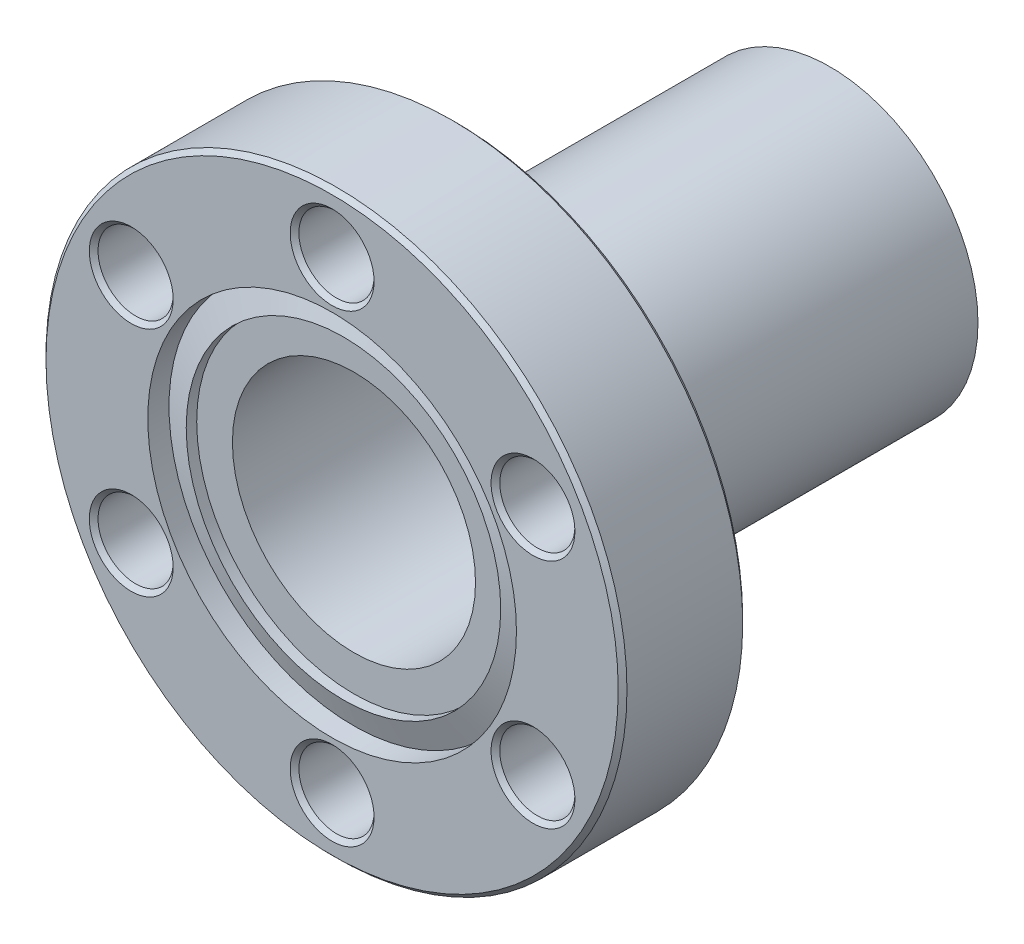
ISO-10303-21;
HEADER;
FILE_DESCRIPTION(('STEP AP214'),'2;1');
FILE_NAME('part.step','',(''),(''),'','','');
FILE_SCHEMA(('AUTOMOTIVE_DESIGN { 1 0 10303 214 1 1 1 1 }'));
ENDSEC;
DATA;
#1=APPLICATION_CONTEXT('core data for automotive mechanical design processes');
#2=APPLICATION_PROTOCOL_DEFINITION('international standard','automotive_design',2000,#1);
#3=PRODUCT_CONTEXT('',#1,'mechanical');
#4=PRODUCT('Part','Part','',(#3));
#5=PRODUCT_RELATED_PRODUCT_CATEGORY('part','',(#4));
#6=PRODUCT_DEFINITION_FORMATION('','',#4);
#7=PRODUCT_DEFINITION_CONTEXT('part definition',#1,'design');
#8=PRODUCT_DEFINITION('design','',#6,#7);
#9=PRODUCT_DEFINITION_SHAPE('','',#8);
#10=(LENGTH_UNIT() NAMED_UNIT(*) SI_UNIT(.MILLI.,.METRE.));
#11=(NAMED_UNIT(*) PLANE_ANGLE_UNIT() SI_UNIT($,.RADIAN.));
#12=(NAMED_UNIT(*) SI_UNIT($,.STERADIAN.) SOLID_ANGLE_UNIT());
#13=UNCERTAINTY_MEASURE_WITH_UNIT(LENGTH_MEASURE(1.E-05),#10,'distance_accuracy_value','');
#14=(GEOMETRIC_REPRESENTATION_CONTEXT(3) GLOBAL_UNCERTAINTY_ASSIGNED_CONTEXT((#13)) GLOBAL_UNIT_ASSIGNED_CONTEXT((#10,
#11,#12)) REPRESENTATION_CONTEXT('',''));
#15=CARTESIAN_POINT('',(0.,0.,0.));
#16=DIRECTION('',(0.,0.,1.));
#17=DIRECTION('',(1.,0.,0.));
#18=AXIS2_PLACEMENT_3D('',#15,#16,#17);
#19=CARTESIAN_POINT('',(16.8909999999993,0.,-7.239));
#20=DIRECTION('',(0.,0.,-1.));
#21=DIRECTION('',(-1.,0.,0.));
#22=AXIS2_PLACEMENT_3D('',#19,#20,#21);
#23=PLANE('',#22);
#24=CARTESIAN_POINT('',(-11.6804310310013,-6.7437,-7.239));
#25=DIRECTION('',(0.,0.,-1.));
#26=DIRECTION('',(-1.,0.,0.));
#27=AXIS2_PLACEMENT_3D('',#24,#25,#26);
#28=CIRCLE('',#27,2.43840000007532);
#29=CARTESIAN_POINT('',(-14.1188310310766,-6.7437,-7.239));
#30=VERTEX_POINT('',#29);
#31=EDGE_CURVE('E113',#30,#30,#28,.F.);
#32=ORIENTED_EDGE('',*,*,#31,.T.);
#33=EDGE_LOOP('',(#32));
#34=FACE_BOUND('',#33,.T.);
#35=CARTESIAN_POINT('',(11.6804310310013,-6.7437,-7.239));
#36=DIRECTION('',(0.,0.,-1.));
#37=DIRECTION('',(-1.,0.,0.));
#38=AXIS2_PLACEMENT_3D('',#35,#36,#37);
#39=CIRCLE('',#38,2.43840000007531);
#40=CARTESIAN_POINT('',(9.24203103092599,-6.7437,-7.239));
#41=VERTEX_POINT('',#40);
#42=EDGE_CURVE('E110',#41,#41,#39,.F.);
#43=ORIENTED_EDGE('',*,*,#42,.T.);
#44=EDGE_LOOP('',(#43));
#45=FACE_BOUND('',#44,.T.);
#46=CARTESIAN_POINT('',(0.,13.4874,-7.239));
#47=DIRECTION('',(0.,0.,-1.));
#48=DIRECTION('',(-1.,0.,0.));
#49=AXIS2_PLACEMENT_3D('',#46,#47,#48);
#50=CIRCLE('',#49,2.43840000007531);
#51=CARTESIAN_POINT('',(-2.43840000007531,13.4874,-7.239));
#52=VERTEX_POINT('',#51);
#53=EDGE_CURVE('E107',#52,#52,#50,.F.);
#54=ORIENTED_EDGE('',*,*,#53,.T.);
#55=EDGE_LOOP('',(#54));
#56=FACE_BOUND('',#55,.T.);
#57=CARTESIAN_POINT('',(-11.6804310310013,6.7437,-7.239));
#58=DIRECTION('',(0.,0.,-1.));
#59=DIRECTION('',(-1.,0.,0.));
#60=AXIS2_PLACEMENT_3D('',#57,#58,#59);
#61=CIRCLE('',#60,2.43840000007532);
#62=CARTESIAN_POINT('',(-14.1188310310766,6.7437,-7.239));
#63=VERTEX_POINT('',#62);
#64=EDGE_CURVE('E104',#63,#63,#61,.F.);
#65=ORIENTED_EDGE('',*,*,#64,.T.);
#66=EDGE_LOOP('',(#65));
#67=FACE_BOUND('',#66,.T.);
#68=CARTESIAN_POINT('',(11.6804310310013,6.7437,-7.239));
#69=DIRECTION('',(0.,0.,-1.));
#70=DIRECTION('',(-1.,0.,0.));
#71=AXIS2_PLACEMENT_3D('',#68,#69,#70);
#72=CIRCLE('',#71,2.43840000007532);
#73=CARTESIAN_POINT('',(9.24203103092598,6.7437,-7.239));
#74=VERTEX_POINT('',#73);
#75=EDGE_CURVE('E101',#74,#74,#72,.F.);
#76=ORIENTED_EDGE('',*,*,#75,.T.);
#77=EDGE_LOOP('',(#76));
#78=FACE_BOUND('',#77,.T.);
#79=CARTESIAN_POINT('',(0.,-13.4874,-7.239));
#80=DIRECTION('',(0.,0.,-1.));
#81=DIRECTION('',(-1.,0.,0.));
#82=AXIS2_PLACEMENT_3D('',#79,#80,#81);
#83=CIRCLE('',#82,2.43840000007531);
#84=CARTESIAN_POINT('',(-2.43840000007531,-13.4874,-7.239));
#85=VERTEX_POINT('',#84);
#86=EDGE_CURVE('E98',#85,#85,#83,.F.);
#87=ORIENTED_EDGE('',*,*,#86,.T.);
#88=EDGE_LOOP('',(#87));
#89=FACE_BOUND('',#88,.T.);
#90=CARTESIAN_POINT('',(0.,0.,-7.239));
#91=DIRECTION('',(0.,0.,-1.));
#92=DIRECTION('',(-1.,0.,0.));
#93=AXIS2_PLACEMENT_3D('',#90,#91,#92);
#94=CIRCLE('',#93,16.6369999999239);
#95=CARTESIAN_POINT('',(-16.6369999999239,0.,-7.239));
#96=VERTEX_POINT('',#95);
#97=EDGE_CURVE('E95',#96,#96,#94,.T.);
#98=ORIENTED_EDGE('',*,*,#97,.T.);
#99=EDGE_LOOP('',(#98));
#100=FACE_BOUND('',#99,.T.);
#101=CARTESIAN_POINT('',(0.,0.,-7.239));
#102=DIRECTION('',(0.,0.,-1.));
#103=DIRECTION('',(-1.,0.,0.));
#104=AXIS2_PLACEMENT_3D('',#101,#102,#103);
#105=CIRCLE('',#104,8.60055437225703);
#106=CARTESIAN_POINT('',(-8.60055437225703,0.,-7.239));
#107=VERTEX_POINT('',#106);
#108=EDGE_CURVE('E135',#107,#107,#105,.T.);
#109=ORIENTED_EDGE('',*,*,#108,.F.);
#110=EDGE_LOOP('',(#109));
#111=FACE_BOUND('',#110,.T.);
#112=ADVANCED_FACE('F30',(#34,#45,#56,#67,#78,#89,#100,#111),#23,.T.);
#113=CARTESIAN_POINT('',(0.,0.,-7.239));
#114=DIRECTION('',(0.,0.,1.));
#115=DIRECTION('',(1.,0.,0.));
#116=AXIS2_PLACEMENT_3D('',#113,#114,#115);
#117=CYLINDRICAL_SURFACE('',#116,16.8909999999993);
#118=CARTESIAN_POINT('',(0.,0.,-6.98499999992468));
#119=DIRECTION('',(0.,0.,-1.));
#120=DIRECTION('',(-1.,0.,0.));
#121=AXIS2_PLACEMENT_3D('',#118,#119,#120);
#122=CIRCLE('',#121,16.8909999999993);
#123=CARTESIAN_POINT('',(-16.8909999999993,0.,-6.98499999992468));
#124=VERTEX_POINT('',#123);
#125=EDGE_CURVE('E116',#124,#124,#122,.F.);
#126=ORIENTED_EDGE('',*,*,#125,.T.);
#127=EDGE_LOOP('',(#126));
#128=FACE_BOUND('',#127,.T.);
#129=CARTESIAN_POINT('',(0.,0.,-0.254000000075326));
#130=DIRECTION('',(0.,0.,1.));
#131=DIRECTION('',(1.,0.,0.));
#132=AXIS2_PLACEMENT_3D('',#129,#130,#131);
#133=CIRCLE('',#132,16.8909999999993);
#134=CARTESIAN_POINT('',(16.8909999999993,0.,-0.254000000075326));
#135=VERTEX_POINT('',#134);
#136=EDGE_CURVE('E119',#135,#135,#133,.F.);
#137=ORIENTED_EDGE('',*,*,#136,.T.);
#138=EDGE_LOOP('',(#137));
#139=FACE_BOUND('',#138,.T.);
#140=ADVANCED_FACE('F162',(#128,#139),#117,.T.);
#141=CARTESIAN_POINT('',(10.7187999999993,0.,0.));
#142=DIRECTION('',(0.,0.,1.));
#143=DIRECTION('',(1.,0.,0.));
#144=AXIS2_PLACEMENT_3D('',#141,#142,#143);
#145=PLANE('',#144);
#146=CARTESIAN_POINT('',(0.,13.4874,0.));
#147=DIRECTION('',(0.,0.,1.));
#148=DIRECTION('',(1.,0.,0.));
#149=AXIS2_PLACEMENT_3D('',#146,#147,#148);
#150=CIRCLE('',#149,2.43840000007531);
#151=CARTESIAN_POINT('',(2.43840000007531,13.4874,0.));
#152=VERTEX_POINT('',#151);
#153=EDGE_CURVE('E62',#152,#152,#150,.F.);
#154=ORIENTED_EDGE('',*,*,#153,.T.);
#155=EDGE_LOOP('',(#154));
#156=FACE_BOUND('',#155,.T.);
#157=CARTESIAN_POINT('',(11.6804310310013,6.7437,0.));
#158=DIRECTION('',(0.,0.,1.));
#159=DIRECTION('',(1.,0.,0.));
#160=AXIS2_PLACEMENT_3D('',#157,#158,#159);
#161=CIRCLE('',#160,2.43840000007531);
#162=CARTESIAN_POINT('',(14.1188310310766,6.7437,0.));
#163=VERTEX_POINT('',#162);
#164=EDGE_CURVE('E65',#163,#163,#161,.F.);
#165=ORIENTED_EDGE('',*,*,#164,.T.);
#166=EDGE_LOOP('',(#165));
#167=FACE_BOUND('',#166,.T.);
#168=CARTESIAN_POINT('',(11.6804310310013,-6.7437,0.));
#169=DIRECTION('',(0.,0.,1.));
#170=DIRECTION('',(1.,0.,0.));
#171=AXIS2_PLACEMENT_3D('',#168,#169,#170);
#172=CIRCLE('',#171,2.43840000007532);
#173=CARTESIAN_POINT('',(14.1188310310766,-6.7437,0.));
#174=VERTEX_POINT('',#173);
#175=EDGE_CURVE('E68',#174,#174,#172,.F.);
#176=ORIENTED_EDGE('',*,*,#175,.T.);
#177=EDGE_LOOP('',(#176));
#178=FACE_BOUND('',#177,.T.);
#179=CARTESIAN_POINT('',(0.,-13.4874,0.));
#180=DIRECTION('',(0.,0.,1.));
#181=DIRECTION('',(1.,0.,0.));
#182=AXIS2_PLACEMENT_3D('',#179,#180,#181);
#183=CIRCLE('',#182,2.43840000007531);
#184=CARTESIAN_POINT('',(2.43840000007531,-13.4874,0.));
#185=VERTEX_POINT('',#184);
#186=EDGE_CURVE('E71',#185,#185,#183,.F.);
#187=ORIENTED_EDGE('',*,*,#186,.T.);
#188=EDGE_LOOP('',(#187));
#189=FACE_BOUND('',#188,.T.);
#190=CARTESIAN_POINT('',(-11.6804310310013,-6.7437,0.));
#191=DIRECTION('',(0.,0.,1.));
#192=DIRECTION('',(1.,0.,0.));
#193=AXIS2_PLACEMENT_3D('',#190,#191,#192);
#194=CIRCLE('',#193,2.43840000007531);
#195=CARTESIAN_POINT('',(-9.24203103092599,-6.7437,0.));
#196=VERTEX_POINT('',#195);
#197=EDGE_CURVE('E74',#196,#196,#194,.F.);
#198=ORIENTED_EDGE('',*,*,#197,.T.);
#199=EDGE_LOOP('',(#198));
#200=FACE_BOUND('',#199,.T.);
#201=CARTESIAN_POINT('',(0.,0.,0.));
#202=DIRECTION('',(0.,0.,1.));
#203=DIRECTION('',(1.,0.,0.));
#204=AXIS2_PLACEMENT_3D('',#201,#202,#203);
#205=CIRCLE('',#204,16.6369999999239);
#206=CARTESIAN_POINT('',(16.6369999999239,0.,0.));
#207=VERTEX_POINT('',#206);
#208=EDGE_CURVE('E77',#207,#207,#205,.T.);
#209=ORIENTED_EDGE('',*,*,#208,.T.);
#210=EDGE_LOOP('',(#209));
#211=FACE_BOUND('',#210,.T.);
#212=CARTESIAN_POINT('',(-11.6804310310013,6.7437,0.));
#213=DIRECTION('',(0.,0.,1.));
#214=DIRECTION('',(1.,0.,0.));
#215=AXIS2_PLACEMENT_3D('',#212,#213,#214);
#216=CIRCLE('',#215,2.43840000007531);
#217=CARTESIAN_POINT('',(-9.24203103092599,6.7437,0.));
#218=VERTEX_POINT('',#217);
#219=EDGE_CURVE('E80',#218,#218,#216,.F.);
#220=ORIENTED_EDGE('',*,*,#219,.T.);
#221=EDGE_LOOP('',(#220));
#222=FACE_BOUND('',#221,.T.);
#223=CARTESIAN_POINT('',(0.,0.,0.));
#224=DIRECTION('',(0.,0.,1.));
#225=DIRECTION('',(1.,0.,0.));
#226=AXIS2_PLACEMENT_3D('',#223,#224,#225);
#227=CIRCLE('',#226,10.7187999999993);
#228=CARTESIAN_POINT('',(10.7187999999993,0.,0.));
#229=VERTEX_POINT('',#228);
#230=EDGE_CURVE('E122',#229,#229,#227,.T.);
#231=ORIENTED_EDGE('',*,*,#230,.F.);
#232=EDGE_LOOP('',(#231));
#233=FACE_BOUND('',#232,.T.);
#234=ADVANCED_FACE('F168',(#156,#167,#178,#189,#200,#211,#222,#233),#145,.T.);
#235=CARTESIAN_POINT('',(0.,0.,-7.239));
#236=DIRECTION('',(0.,0.,1.));
#237=DIRECTION('',(1.,0.,0.));
#238=AXIS2_PLACEMENT_3D('',#235,#236,#237);
#239=CYLINDRICAL_SURFACE('',#238,10.7187999999993);
#240=ORIENTED_EDGE('',*,*,#230,.T.);
#241=EDGE_LOOP('',(#240));
#242=FACE_BOUND('',#241,.T.);
#243=CARTESIAN_POINT('',(0.,0.,-1.2335803249223));
#244=DIRECTION('',(0.,0.,1.));
#245=DIRECTION('',(1.,0.,0.));
#246=AXIS2_PLACEMENT_3D('',#243,#244,#245);
#247=CIRCLE('',#246,10.7187999999993);
#248=CARTESIAN_POINT('',(10.7187999999993,0.,-1.2335803249223));
#249=VERTEX_POINT('',#248);
#250=EDGE_CURVE('E125',#249,#249,#247,.T.);
#251=ORIENTED_EDGE('',*,*,#250,.F.);
#252=EDGE_LOOP('',(#251));
#253=FACE_BOUND('',#252,.T.);
#254=ADVANCED_FACE('F187',(#242,#253),#239,.F.);
#255=CARTESIAN_POINT('',(0.,0.,-0.6604));
#256=DIRECTION('',(0.,0.,-1.));
#257=DIRECTION('',(-1.,0.,0.));
#258=AXIS2_PLACEMENT_3D('',#255,#256,#257);
#259=CONICAL_SURFACE('',#258,9.144,1.22173047639595);
#260=ORIENTED_EDGE('',*,*,#250,.T.);
#261=EDGE_LOOP('',(#260));
#262=FACE_BOUND('',#261,.T.);
#263=CARTESIAN_POINT('',(0.,0.,-0.6604));
#264=DIRECTION('',(0.,0.,1.));
#265=DIRECTION('',(1.,0.,0.));
#266=AXIS2_PLACEMENT_3D('',#263,#264,#265);
#267=CIRCLE('',#266,9.144);
#268=CARTESIAN_POINT('',(9.144,0.,-0.6604));
#269=VERTEX_POINT('',#268);
#270=EDGE_CURVE('E128',#269,#269,#267,.T.);
#271=ORIENTED_EDGE('',*,*,#270,.F.);
#272=EDGE_LOOP('',(#271));
#273=FACE_BOUND('',#272,.T.);
#274=ADVANCED_FACE('F183',(#262,#273),#259,.T.);
#275=CARTESIAN_POINT('',(0.,0.,-7.239));
#276=DIRECTION('',(0.,0.,1.));
#277=DIRECTION('',(1.,0.,0.));
#278=AXIS2_PLACEMENT_3D('',#275,#276,#277);
#279=CYLINDRICAL_SURFACE('',#278,9.144);
#280=ORIENTED_EDGE('',*,*,#270,.T.);
#281=EDGE_LOOP('',(#280));
#282=FACE_BOUND('',#281,.T.);
#283=CARTESIAN_POINT('',(0.,0.,-1.27));
#284=DIRECTION('',(0.,0.,1.));
#285=DIRECTION('',(1.,0.,0.));
#286=AXIS2_PLACEMENT_3D('',#283,#284,#285);
#287=CIRCLE('',#286,9.144);
#288=CARTESIAN_POINT('',(9.144,0.,-1.27));
#289=VERTEX_POINT('',#288);
#290=EDGE_CURVE('E131',#289,#289,#287,.T.);
#291=ORIENTED_EDGE('',*,*,#290,.F.);
#292=EDGE_LOOP('',(#291));
#293=FACE_BOUND('',#292,.T.);
#294=ADVANCED_FACE('F179',(#282,#293),#279,.F.);
#295=CARTESIAN_POINT('',(6.79471117366842,0.,-1.27));
#296=DIRECTION('',(0.,0.,1.));
#297=DIRECTION('',(1.,0.,0.));
#298=AXIS2_PLACEMENT_3D('',#295,#296,#297);
#299=PLANE('',#298);
#300=CARTESIAN_POINT('',(0.,0.,-1.27));
#301=DIRECTION('',(0.,0.,1.));
#302=DIRECTION('',(1.,0.,0.));
#303=AXIS2_PLACEMENT_3D('',#300,#301,#302);
#304=CIRCLE('',#303,7.06808435379295);
#305=CARTESIAN_POINT('',(7.06808435379295,0.,-1.27));
#306=VERTEX_POINT('',#305);
#307=EDGE_CURVE('E138',#306,#306,#304,.T.);
#308=ORIENTED_EDGE('',*,*,#307,.F.);
#309=EDGE_LOOP('',(#308));
#310=FACE_BOUND('',#309,.T.);
#311=ORIENTED_EDGE('',*,*,#290,.T.);
#312=EDGE_LOOP('',(#311));
#313=FACE_BOUND('',#312,.T.);
#314=ADVANCED_FACE('F176',(#310,#313),#299,.T.);
#315=CARTESIAN_POINT('',(-11.6804310310013,6.7437,0.));
#316=DIRECTION('',(0.,0.,1.));
#317=DIRECTION('',(1.,0.,0.));
#318=AXIS2_PLACEMENT_3D('',#315,#316,#317);
#319=CYLINDRICAL_SURFACE('',#318,2.18439999999999);
#320=CARTESIAN_POINT('',(-11.6804310310013,6.7437,-6.98499999992466));
#321=DIRECTION('',(0.,0.,-1.));
#322=DIRECTION('',(-1.,0.,0.));
#323=AXIS2_PLACEMENT_3D('',#320,#321,#322);
#324=CIRCLE('',#323,2.18439999999999);
#325=CARTESIAN_POINT('',(-13.8648310310013,6.7437,-6.98499999992466));
#326=VERTEX_POINT('',#325);
#327=EDGE_CURVE('E50',#326,#326,#324,.T.);
#328=ORIENTED_EDGE('',*,*,#327,.T.);
#329=EDGE_LOOP('',(#328));
#330=FACE_BOUND('',#329,.T.);
#331=CARTESIAN_POINT('',(-11.6804310310013,6.7437,-0.254000000075322));
#332=DIRECTION('',(0.,0.,1.));
#333=DIRECTION('',(1.,0.,0.));
#334=AXIS2_PLACEMENT_3D('',#331,#332,#333);
#335=CIRCLE('',#334,2.18439999999999);
#336=CARTESIAN_POINT('',(-9.49603103100131,6.7437,-0.254000000075322));
#337=VERTEX_POINT('',#336);
#338=EDGE_CURVE('E53',#337,#337,#335,.T.);
#339=ORIENTED_EDGE('',*,*,#338,.T.);
#340=EDGE_LOOP('',(#339));
#341=FACE_BOUND('',#340,.T.);
#342=ADVANCED_FACE('F174',(#330,#341),#319,.F.);
#343=CARTESIAN_POINT('',(-11.6804310310013,-6.7437,0.));
#344=DIRECTION('',(0.,0.,1.));
#345=DIRECTION('',(1.,0.,0.));
#346=AXIS2_PLACEMENT_3D('',#343,#344,#345);
#347=CYLINDRICAL_SURFACE('',#346,2.18439999999999);
#348=CARTESIAN_POINT('',(-11.6804310310013,-6.7437,-6.98499999992466));
#349=DIRECTION('',(0.,0.,-1.));
#350=DIRECTION('',(-1.,0.,0.));
#351=AXIS2_PLACEMENT_3D('',#348,#349,#350);
#352=CIRCLE('',#351,2.18439999999999);
#353=CARTESIAN_POINT('',(-13.8648310310013,-6.7437,-6.98499999992466));
#354=VERTEX_POINT('',#353);
#355=EDGE_CURVE('E10',#354,#354,#352,.T.);
#356=ORIENTED_EDGE('',*,*,#355,.T.);
#357=EDGE_LOOP('',(#356));
#358=FACE_BOUND('',#357,.T.);
#359=CARTESIAN_POINT('',(-11.6804310310013,-6.7437,-0.254000000075322));
#360=DIRECTION('',(0.,0.,1.));
#361=DIRECTION('',(1.,0.,0.));
#362=AXIS2_PLACEMENT_3D('',#359,#360,#361);
#363=CIRCLE('',#362,2.18439999999999);
#364=CARTESIAN_POINT('',(-9.49603103100131,-6.7437,-0.254000000075322));
#365=VERTEX_POINT('',#364);
#366=EDGE_CURVE('E37',#365,#365,#363,.T.);
#367=ORIENTED_EDGE('',*,*,#366,.T.);
#368=EDGE_LOOP('',(#367));
#369=FACE_BOUND('',#368,.T.);
#370=ADVANCED_FACE('F269',(#358,#369),#347,.F.);
#371=CARTESIAN_POINT('',(0.,-13.4874,0.));
#372=DIRECTION('',(0.,0.,1.));
#373=DIRECTION('',(1.,0.,0.));
#374=AXIS2_PLACEMENT_3D('',#371,#372,#373);
#375=CYLINDRICAL_SURFACE('',#374,2.18439999999999);
#376=CARTESIAN_POINT('',(0.,-13.4874,-6.98499999992467));
#377=DIRECTION('',(0.,0.,-1.));
#378=DIRECTION('',(-1.,0.,0.));
#379=AXIS2_PLACEMENT_3D('',#376,#377,#378);
#380=CIRCLE('',#379,2.18439999999999);
#381=CARTESIAN_POINT('',(-2.18439999999999,-13.4874,-6.98499999992467));
#382=VERTEX_POINT('',#381);
#383=EDGE_CURVE('E89',#382,#382,#380,.T.);
#384=ORIENTED_EDGE('',*,*,#383,.T.);
#385=EDGE_LOOP('',(#384));
#386=FACE_BOUND('',#385,.T.);
#387=CARTESIAN_POINT('',(0.,-13.4874,-0.254000000075322));
#388=DIRECTION('',(0.,0.,1.));
#389=DIRECTION('',(1.,0.,0.));
#390=AXIS2_PLACEMENT_3D('',#387,#388,#389);
#391=CIRCLE('',#390,2.18439999999999);
#392=CARTESIAN_POINT('',(2.18439999999999,-13.4874,-0.254000000075322));
#393=VERTEX_POINT('',#392);
#394=EDGE_CURVE('E92',#393,#393,#391,.T.);
#395=ORIENTED_EDGE('',*,*,#394,.T.);
#396=EDGE_LOOP('',(#395));
#397=FACE_BOUND('',#396,.T.);
#398=ADVANCED_FACE('F274',(#386,#397),#375,.F.);
#399=CARTESIAN_POINT('',(11.6804310310013,6.7437,0.));
#400=DIRECTION('',(0.,0.,1.));
#401=DIRECTION('',(1.,0.,0.));
#402=AXIS2_PLACEMENT_3D('',#399,#400,#401);
#403=CYLINDRICAL_SURFACE('',#402,2.18439999999999);
#404=CARTESIAN_POINT('',(11.6804310310013,6.7437,-6.98499999992466));
#405=DIRECTION('',(0.,0.,-1.));
#406=DIRECTION('',(-1.,0.,0.));
#407=AXIS2_PLACEMENT_3D('',#404,#405,#406);
#408=CIRCLE('',#407,2.18439999999999);
#409=CARTESIAN_POINT('',(9.49603103100131,6.7437,-6.98499999992466));
#410=VERTEX_POINT('',#409);
#411=EDGE_CURVE('E83',#410,#410,#408,.T.);
#412=ORIENTED_EDGE('',*,*,#411,.T.);
#413=EDGE_LOOP('',(#412));
#414=FACE_BOUND('',#413,.T.);
#415=CARTESIAN_POINT('',(11.6804310310013,6.7437,-0.254000000075322));
#416=DIRECTION('',(0.,0.,1.));
#417=DIRECTION('',(1.,0.,0.));
#418=AXIS2_PLACEMENT_3D('',#415,#416,#417);
#419=CIRCLE('',#418,2.18439999999999);
#420=CARTESIAN_POINT('',(13.8648310310013,6.7437,-0.254000000075322));
#421=VERTEX_POINT('',#420);
#422=EDGE_CURVE('E86',#421,#421,#419,.T.);
#423=ORIENTED_EDGE('',*,*,#422,.T.);
#424=EDGE_LOOP('',(#423));
#425=FACE_BOUND('',#424,.T.);
#426=ADVANCED_FACE('F293',(#414,#425),#403,.F.);
#427=CARTESIAN_POINT('',(11.6804310310013,-6.7437,-7.239));
#428=DIRECTION('',(0.,0.,-1.));
#429=DIRECTION('',(-1.,0.,0.));
#430=AXIS2_PLACEMENT_3D('',#427,#428,#429);
#431=CYLINDRICAL_SURFACE('',#430,2.18439999999999);
#432=CARTESIAN_POINT('',(11.6804310310013,-6.7437,-0.254000000075341));
#433=DIRECTION('',(0.,0.,1.));
#434=DIRECTION('',(1.,0.,0.));
#435=AXIS2_PLACEMENT_3D('',#432,#433,#434);
#436=CIRCLE('',#435,2.18439999999999);
#437=CARTESIAN_POINT('',(13.8648310310013,-6.7437,-0.254000000075341));
#438=VERTEX_POINT('',#437);
#439=EDGE_CURVE('E41',#438,#438,#436,.T.);
#440=ORIENTED_EDGE('',*,*,#439,.T.);
#441=EDGE_LOOP('',(#440));
#442=FACE_BOUND('',#441,.T.);
#443=CARTESIAN_POINT('',(11.6804310310013,-6.7437,-6.98499999992468));
#444=DIRECTION('',(0.,0.,-1.));
#445=DIRECTION('',(-1.,0.,0.));
#446=AXIS2_PLACEMENT_3D('',#443,#444,#445);
#447=CIRCLE('',#446,2.18439999999999);
#448=CARTESIAN_POINT('',(9.49603103100131,-6.7437,-6.98499999992468));
#449=VERTEX_POINT('',#448);
#450=EDGE_CURVE('E45',#449,#449,#447,.T.);
#451=ORIENTED_EDGE('',*,*,#450,.T.);
#452=EDGE_LOOP('',(#451));
#453=FACE_BOUND('',#452,.T.);
#454=ADVANCED_FACE('F299',(#442,#453),#431,.F.);
#455=CARTESIAN_POINT('',(0.,13.4874,-7.239));
#456=DIRECTION('',(0.,0.,-1.));
#457=DIRECTION('',(-1.,0.,0.));
#458=AXIS2_PLACEMENT_3D('',#455,#456,#457);
#459=CYLINDRICAL_SURFACE('',#458,2.18439999999999);
#460=CARTESIAN_POINT('',(0.,13.4874,-0.254000000075334));
#461=DIRECTION('',(0.,0.,1.));
#462=DIRECTION('',(1.,0.,0.));
#463=AXIS2_PLACEMENT_3D('',#460,#461,#462);
#464=CIRCLE('',#463,2.18439999999999);
#465=CARTESIAN_POINT('',(2.18439999999999,13.4874,-0.254000000075334));
#466=VERTEX_POINT('',#465);
#467=EDGE_CURVE('E56',#466,#466,#464,.T.);
#468=ORIENTED_EDGE('',*,*,#467,.T.);
#469=EDGE_LOOP('',(#468));
#470=FACE_BOUND('',#469,.T.);
#471=CARTESIAN_POINT('',(0.,13.4874,-6.98499999992468));
#472=DIRECTION('',(0.,0.,-1.));
#473=DIRECTION('',(-1.,0.,0.));
#474=AXIS2_PLACEMENT_3D('',#471,#472,#473);
#475=CIRCLE('',#474,2.18439999999999);
#476=CARTESIAN_POINT('',(-2.18439999999999,13.4874,-6.98499999992468));
#477=VERTEX_POINT('',#476);
#478=EDGE_CURVE('E59',#477,#477,#475,.T.);
#479=ORIENTED_EDGE('',*,*,#478,.T.);
#480=EDGE_LOOP('',(#479));
#481=FACE_BOUND('',#480,.T.);
#482=ADVANCED_FACE('F199',(#470,#481),#459,.F.);
#483=CARTESIAN_POINT('',(0.,0.,-6.98499999992468));
#484=DIRECTION('',(0.,0.,1.));
#485=DIRECTION('',(1.,0.,0.));
#486=AXIS2_PLACEMENT_3D('',#483,#484,#485);
#487=CONICAL_SURFACE('',#486,16.8909999999993,0.785398163397462);
#488=ORIENTED_EDGE('',*,*,#97,.F.);
#489=EDGE_LOOP('',(#488));
#490=FACE_BOUND('',#489,.T.);
#491=ORIENTED_EDGE('',*,*,#125,.F.);
#492=EDGE_LOOP('',(#491));
#493=FACE_BOUND('',#492,.T.);
#494=ADVANCED_FACE('F195',(#490,#493),#487,.T.);
#495=CARTESIAN_POINT('',(0.,-13.4874,-7.239));
#496=DIRECTION('',(0.,0.,-1.));
#497=DIRECTION('',(-1.,0.,0.));
#498=AXIS2_PLACEMENT_3D('',#495,#496,#497);
#499=CONICAL_SURFACE('',#498,2.43840000007531,0.785398163397436);
#500=ORIENTED_EDGE('',*,*,#383,.F.);
#501=EDGE_LOOP('',(#500));
#502=FACE_BOUND('',#501,.T.);
#503=ORIENTED_EDGE('',*,*,#86,.F.);
#504=EDGE_LOOP('',(#503));
#505=FACE_BOUND('',#504,.T.);
#506=ADVANCED_FACE('F198',(#502,#505),#499,.F.);
#507=CARTESIAN_POINT('',(11.6804310310013,6.7437,-7.239));
#508=DIRECTION('',(0.,0.,-1.));
#509=DIRECTION('',(-1.,0.,0.));
#510=AXIS2_PLACEMENT_3D('',#507,#508,#509);
#511=CONICAL_SURFACE('',#510,2.43840000007532,0.785398163397436);
#512=ORIENTED_EDGE('',*,*,#411,.F.);
#513=EDGE_LOOP('',(#512));
#514=FACE_BOUND('',#513,.T.);
#515=ORIENTED_EDGE('',*,*,#75,.F.);
#516=EDGE_LOOP('',(#515));
#517=FACE_BOUND('',#516,.T.);
#518=ADVANCED_FACE('F203',(#514,#517),#511,.F.);
#519=CARTESIAN_POINT('',(0.,13.4874,0.));
#520=DIRECTION('',(0.,0.,1.));
#521=DIRECTION('',(1.,0.,0.));
#522=AXIS2_PLACEMENT_3D('',#519,#520,#521);
#523=CONICAL_SURFACE('',#522,2.43840000007531,0.785398163397437);
#524=ORIENTED_EDGE('',*,*,#467,.F.);
#525=EDGE_LOOP('',(#524));
#526=FACE_BOUND('',#525,.T.);
#527=ORIENTED_EDGE('',*,*,#153,.F.);
#528=EDGE_LOOP('',(#527));
#529=FACE_BOUND('',#528,.T.);
#530=ADVANCED_FACE('F207',(#526,#529),#523,.F.);
#531=CARTESIAN_POINT('',(-11.6804310310013,6.7437,-7.239));
#532=DIRECTION('',(0.,0.,-1.));
#533=DIRECTION('',(-1.,0.,0.));
#534=AXIS2_PLACEMENT_3D('',#531,#532,#533);
#535=CONICAL_SURFACE('',#534,2.43840000007532,0.785398163397436);
#536=ORIENTED_EDGE('',*,*,#327,.F.);
#537=EDGE_LOOP('',(#536));
#538=FACE_BOUND('',#537,.T.);
#539=ORIENTED_EDGE('',*,*,#64,.F.);
#540=EDGE_LOOP('',(#539));
#541=FACE_BOUND('',#540,.T.);
#542=ADVANCED_FACE('F211',(#538,#541),#535,.F.);
#543=CARTESIAN_POINT('',(11.6804310310013,6.7437,-0.254000000075322));
#544=DIRECTION('',(0.,0.,1.));
#545=DIRECTION('',(1.,0.,0.));
#546=AXIS2_PLACEMENT_3D('',#543,#544,#545);
#547=CONICAL_SURFACE('',#546,2.18439999999999,0.78539816339746);
#548=ORIENTED_EDGE('',*,*,#164,.F.);
#549=EDGE_LOOP('',(#548));
#550=FACE_BOUND('',#549,.T.);
#551=ORIENTED_EDGE('',*,*,#422,.F.);
#552=EDGE_LOOP('',(#551));
#553=FACE_BOUND('',#552,.T.);
#554=ADVANCED_FACE('F215',(#550,#553),#547,.F.);
#555=CARTESIAN_POINT('',(0.,13.4874,-6.98499999992468));
#556=DIRECTION('',(0.,0.,-1.));
#557=DIRECTION('',(-1.,0.,0.));
#558=AXIS2_PLACEMENT_3D('',#555,#556,#557);
#559=CONICAL_SURFACE('',#558,2.18439999999999,0.785398163397459);
#560=ORIENTED_EDGE('',*,*,#53,.F.);
#561=EDGE_LOOP('',(#560));
#562=FACE_BOUND('',#561,.T.);
#563=ORIENTED_EDGE('',*,*,#478,.F.);
#564=EDGE_LOOP('',(#563));
#565=FACE_BOUND('',#564,.T.);
#566=ADVANCED_FACE('F219',(#562,#565),#559,.F.);
#567=CARTESIAN_POINT('',(11.6804310310013,-6.7437,0.));
#568=DIRECTION('',(0.,0.,1.));
#569=DIRECTION('',(1.,0.,0.));
#570=AXIS2_PLACEMENT_3D('',#567,#568,#569);
#571=CONICAL_SURFACE('',#570,2.43840000007532,0.785398163397438);
#572=ORIENTED_EDGE('',*,*,#439,.F.);
#573=EDGE_LOOP('',(#572));
#574=FACE_BOUND('',#573,.T.);
#575=ORIENTED_EDGE('',*,*,#175,.F.);
#576=EDGE_LOOP('',(#575));
#577=FACE_BOUND('',#576,.T.);
#578=ADVANCED_FACE('F223',(#574,#577),#571,.F.);
#579=CARTESIAN_POINT('',(11.6804310310013,-6.7437,-6.98499999992468));
#580=DIRECTION('',(0.,0.,-1.));
#581=DIRECTION('',(-1.,0.,0.));
#582=AXIS2_PLACEMENT_3D('',#579,#580,#581);
#583=CONICAL_SURFACE('',#582,2.18439999999999,0.78539816339746);
#584=ORIENTED_EDGE('',*,*,#42,.F.);
#585=EDGE_LOOP('',(#584));
#586=FACE_BOUND('',#585,.T.);
#587=ORIENTED_EDGE('',*,*,#450,.F.);
#588=EDGE_LOOP('',(#587));
#589=FACE_BOUND('',#588,.T.);
#590=ADVANCED_FACE('F227',(#586,#589),#583,.F.);
#591=CARTESIAN_POINT('',(0.,-13.4874,-0.254000000075322));
#592=DIRECTION('',(0.,0.,1.));
#593=DIRECTION('',(1.,0.,0.));
#594=AXIS2_PLACEMENT_3D('',#591,#592,#593);
#595=CONICAL_SURFACE('',#594,2.18439999999999,0.78539816339746);
#596=ORIENTED_EDGE('',*,*,#186,.F.);
#597=EDGE_LOOP('',(#596));
#598=FACE_BOUND('',#597,.T.);
#599=ORIENTED_EDGE('',*,*,#394,.F.);
#600=EDGE_LOOP('',(#599));
#601=FACE_BOUND('',#600,.T.);
#602=ADVANCED_FACE('F231',(#598,#601),#595,.F.);
#603=CARTESIAN_POINT('',(-11.6804310310013,-6.7437,-7.239));
#604=DIRECTION('',(0.,0.,-1.));
#605=DIRECTION('',(-1.,0.,0.));
#606=AXIS2_PLACEMENT_3D('',#603,#604,#605);
#607=CONICAL_SURFACE('',#606,2.43840000007532,0.785398163397436);
#608=ORIENTED_EDGE('',*,*,#355,.F.);
#609=EDGE_LOOP('',(#608));
#610=FACE_BOUND('',#609,.T.);
#611=ORIENTED_EDGE('',*,*,#31,.F.);
#612=EDGE_LOOP('',(#611));
#613=FACE_BOUND('',#612,.T.);
#614=ADVANCED_FACE('F235',(#610,#613),#607,.F.);
#615=CARTESIAN_POINT('',(-11.6804310310013,-6.7437,-0.254000000075322));
#616=DIRECTION('',(0.,0.,1.));
#617=DIRECTION('',(1.,0.,0.));
#618=AXIS2_PLACEMENT_3D('',#615,#616,#617);
#619=CONICAL_SURFACE('',#618,2.18439999999999,0.78539816339746);
#620=ORIENTED_EDGE('',*,*,#197,.F.);
#621=EDGE_LOOP('',(#620));
#622=FACE_BOUND('',#621,.T.);
#623=ORIENTED_EDGE('',*,*,#366,.F.);
#624=EDGE_LOOP('',(#623));
#625=FACE_BOUND('',#624,.T.);
#626=ADVANCED_FACE('F239',(#622,#625),#619,.F.);
#627=CARTESIAN_POINT('',(0.,0.,0.));
#628=DIRECTION('',(0.,0.,-1.));
#629=DIRECTION('',(-1.,0.,0.));
#630=AXIS2_PLACEMENT_3D('',#627,#628,#629);
#631=CONICAL_SURFACE('',#630,16.6369999999239,0.785398163397448);
#632=ORIENTED_EDGE('',*,*,#136,.F.);
#633=EDGE_LOOP('',(#632));
#634=FACE_BOUND('',#633,.T.);
#635=ORIENTED_EDGE('',*,*,#208,.F.);
#636=EDGE_LOOP('',(#635));
#637=FACE_BOUND('',#636,.T.);
#638=ADVANCED_FACE('F242',(#634,#637),#631,.T.);
#639=CARTESIAN_POINT('',(-11.6804310310013,6.7437,-0.254000000075322));
#640=DIRECTION('',(0.,0.,1.));
#641=DIRECTION('',(1.,0.,0.));
#642=AXIS2_PLACEMENT_3D('',#639,#640,#641);
#643=CONICAL_SURFACE('',#642,2.18439999999999,0.78539816339746);
#644=ORIENTED_EDGE('',*,*,#219,.F.);
#645=EDGE_LOOP('',(#644));
#646=FACE_BOUND('',#645,.T.);
#647=ORIENTED_EDGE('',*,*,#338,.F.);
#648=EDGE_LOOP('',(#647));
#649=FACE_BOUND('',#648,.T.);
#650=ADVANCED_FACE('F32',(#646,#649),#643,.F.);
#651=CARTESIAN_POINT('',(0.,0.,-28.956));
#652=DIRECTION('',(0.,0.,1.));
#653=DIRECTION('',(1.,0.,0.));
#654=AXIS2_PLACEMENT_3D('',#651,#652,#653);
#655=CYLINDRICAL_SURFACE('',#654,8.60055437225703);
#656=CARTESIAN_POINT('',(0.,0.,-28.956));
#657=DIRECTION('',(0.,0.,-1.));
#658=DIRECTION('',(-1.,0.,0.));
#659=AXIS2_PLACEMENT_3D('',#656,#657,#658);
#660=CIRCLE('',#659,8.60055437225703);
#661=CARTESIAN_POINT('',(-8.60055437225703,0.,-28.956));
#662=VERTEX_POINT('',#661);
#663=EDGE_CURVE('E134',#662,#662,#660,.T.);
#664=ORIENTED_EDGE('',*,*,#663,.F.);
#665=EDGE_LOOP('',(#664));
#666=FACE_BOUND('',#665,.T.);
#667=ORIENTED_EDGE('',*,*,#108,.T.);
#668=EDGE_LOOP('',(#667));
#669=FACE_BOUND('',#668,.T.);
#670=ADVANCED_FACE('F152',(#666,#669),#655,.T.);
#671=CARTESIAN_POINT('',(0.,0.,-28.956));
#672=DIRECTION('',(0.,0.,-1.));
#673=DIRECTION('',(-1.,0.,0.));
#674=AXIS2_PLACEMENT_3D('',#671,#672,#673);
#675=PLANE('',#674);
#676=CARTESIAN_POINT('',(0.,0.,-28.956));
#677=DIRECTION('',(0.,0.,-1.));
#678=DIRECTION('',(-1.,0.,0.));
#679=AXIS2_PLACEMENT_3D('',#676,#677,#678);
#680=CIRCLE('',#679,7.06808435379295);
#681=CARTESIAN_POINT('',(-7.06808435379295,0.,-28.956));
#682=VERTEX_POINT('',#681);
#683=EDGE_CURVE('E143',#682,#682,#680,.T.);
#684=ORIENTED_EDGE('',*,*,#683,.F.);
#685=EDGE_LOOP('',(#684));
#686=FACE_BOUND('',#685,.T.);
#687=ORIENTED_EDGE('',*,*,#663,.T.);
#688=EDGE_LOOP('',(#687));
#689=FACE_BOUND('',#688,.T.);
#690=ADVANCED_FACE('F149',(#686,#689),#675,.T.);
#691=CARTESIAN_POINT('',(0.,0.,0.));
#692=DIRECTION('',(0.,0.,-1.));
#693=DIRECTION('',(-1.,0.,0.));
#694=AXIS2_PLACEMENT_3D('',#691,#692,#693);
#695=CYLINDRICAL_SURFACE('',#694,7.06808435379295);
#696=ORIENTED_EDGE('',*,*,#307,.T.);
#697=EDGE_LOOP('',(#696));
#698=FACE_BOUND('',#697,.T.);
#699=ORIENTED_EDGE('',*,*,#683,.T.);
#700=EDGE_LOOP('',(#699));
#701=FACE_BOUND('',#700,.T.);
#702=ADVANCED_FACE('F147',(#698,#701),#695,.F.);
#703=CLOSED_SHELL('',(#112,#140,#234,#254,#274,#294,#314,#342,#370,#398,#426,#454,#482,#494,
#506,#518,#530,#542,#554,#566,#578,#590,#602,#614,#626,#638,#650,#670,#690,#702));
#704=MANIFOLD_SOLID_BREP('B2',#703);
#705=ADVANCED_BREP_SHAPE_REPRESENTATION('',(#18,#704),#14);
#706=SHAPE_DEFINITION_REPRESENTATION(#9,#705);
ENDSEC;
END-ISO-10303-21;
